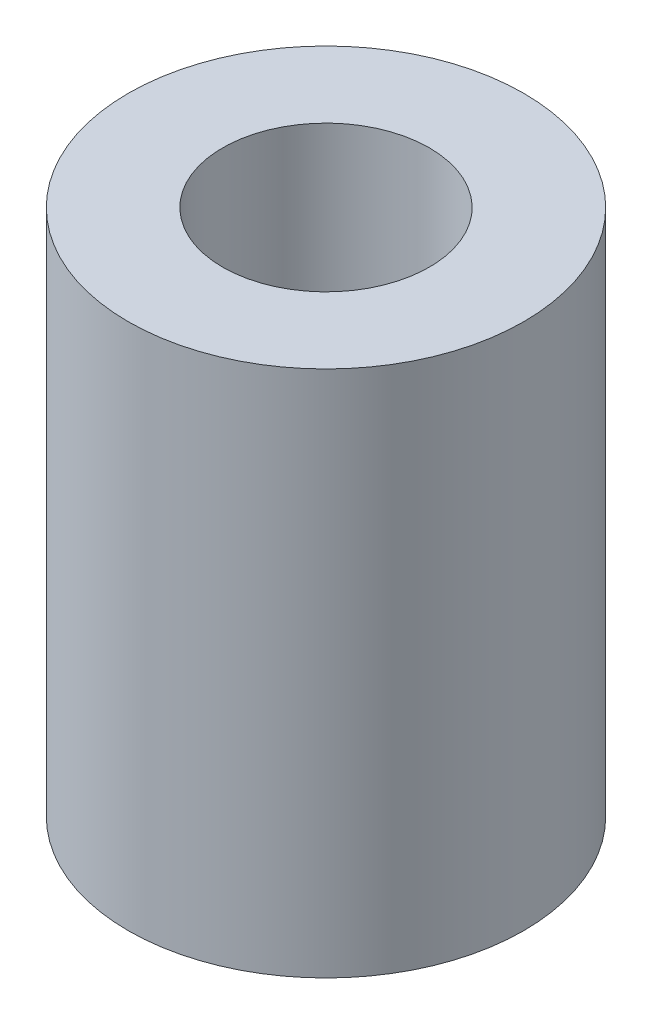
ISO-10303-21;
HEADER;
FILE_DESCRIPTION(('STEP AP214'),'2;1');
FILE_NAME('part.step','',(''),(''),'','','');
FILE_SCHEMA(('AUTOMOTIVE_DESIGN { 1 0 10303 214 1 1 1 1 }'));
ENDSEC;
DATA;
#1=APPLICATION_CONTEXT('core data for automotive mechanical design processes');
#2=APPLICATION_PROTOCOL_DEFINITION('international standard','automotive_design',2000,#1);
#3=PRODUCT_CONTEXT('',#1,'mechanical');
#4=PRODUCT('Part','Part','',(#3));
#5=PRODUCT_RELATED_PRODUCT_CATEGORY('part','',(#4));
#6=PRODUCT_DEFINITION_FORMATION('','',#4);
#7=PRODUCT_DEFINITION_CONTEXT('part definition',#1,'design');
#8=PRODUCT_DEFINITION('design','',#6,#7);
#9=PRODUCT_DEFINITION_SHAPE('','',#8);
#10=(LENGTH_UNIT() NAMED_UNIT(*) SI_UNIT(.MILLI.,.METRE.));
#11=(NAMED_UNIT(*) PLANE_ANGLE_UNIT() SI_UNIT($,.RADIAN.));
#12=(NAMED_UNIT(*) SI_UNIT($,.STERADIAN.) SOLID_ANGLE_UNIT());
#13=UNCERTAINTY_MEASURE_WITH_UNIT(LENGTH_MEASURE(1.E-05),#10,'distance_accuracy_value','');
#14=(GEOMETRIC_REPRESENTATION_CONTEXT(3) GLOBAL_UNCERTAINTY_ASSIGNED_CONTEXT((#13)) GLOBAL_UNIT_ASSIGNED_CONTEXT((#10,
#11,#12)) REPRESENTATION_CONTEXT('',''));
#15=CARTESIAN_POINT('',(0.,0.,0.));
#16=DIRECTION('',(0.,0.,1.));
#17=DIRECTION('',(1.,0.,0.));
#18=AXIS2_PLACEMENT_3D('',#15,#16,#17);
#19=CARTESIAN_POINT('',(0.,-6.35,0.));
#20=DIRECTION('',(0.,1.,0.));
#21=DIRECTION('',(0.,0.,1.));
#22=AXIS2_PLACEMENT_3D('',#19,#20,#21);
#23=CYLINDRICAL_SURFACE('',#22,4.7625);
#24=CARTESIAN_POINT('',(0.,-6.35,0.));
#25=DIRECTION('',(0.,1.,0.));
#26=DIRECTION('',(0.,0.,-1.));
#27=AXIS2_PLACEMENT_3D('',#24,#25,#26);
#28=CIRCLE('',#27,4.7625);
#29=CARTESIAN_POINT('',(0.,-6.35,-4.7625));
#30=VERTEX_POINT('',#29);
#31=EDGE_CURVE('E10',#30,#30,#28,.T.);
#32=ORIENTED_EDGE('',*,*,#31,.T.);
#33=EDGE_LOOP('',(#32));
#34=FACE_BOUND('',#33,.T.);
#35=CARTESIAN_POINT('',(0.,6.35,0.));
#36=DIRECTION('',(0.,1.,0.));
#37=DIRECTION('',(0.,0.,-1.));
#38=AXIS2_PLACEMENT_3D('',#35,#36,#37);
#39=CIRCLE('',#38,4.7625);
#40=CARTESIAN_POINT('',(0.,6.35,-4.7625));
#41=VERTEX_POINT('',#40);
#42=EDGE_CURVE('E42',#41,#41,#39,.T.);
#43=ORIENTED_EDGE('',*,*,#42,.F.);
#44=EDGE_LOOP('',(#43));
#45=FACE_BOUND('',#44,.T.);
#46=ADVANCED_FACE('F39',(#34,#45),#23,.T.);
#47=CARTESIAN_POINT('',(0.,-6.35,0.));
#48=DIRECTION('',(0.,-1.,0.));
#49=DIRECTION('',(0.,0.,-1.));
#50=AXIS2_PLACEMENT_3D('',#47,#48,#49);
#51=PLANE('',#50);
#52=CARTESIAN_POINT('',(0.,-6.35,0.));
#53=DIRECTION('',(0.,1.,0.));
#54=DIRECTION('',(0.,0.,-1.));
#55=AXIS2_PLACEMENT_3D('',#52,#53,#54);
#56=CIRCLE('',#55,2.4892);
#57=CARTESIAN_POINT('',(0.,-6.35,-2.4892));
#58=VERTEX_POINT('',#57);
#59=EDGE_CURVE('E49',#58,#58,#56,.T.);
#60=ORIENTED_EDGE('',*,*,#59,.T.);
#61=EDGE_LOOP('',(#60));
#62=FACE_BOUND('',#61,.T.);
#63=ORIENTED_EDGE('',*,*,#31,.F.);
#64=EDGE_LOOP('',(#63));
#65=FACE_BOUND('',#64,.T.);
#66=ADVANCED_FACE('F57',(#62,#65),#51,.T.);
#67=CARTESIAN_POINT('',(0.,6.35,0.));
#68=DIRECTION('',(0.,-1.,0.));
#69=DIRECTION('',(0.,0.,-1.));
#70=AXIS2_PLACEMENT_3D('',#67,#68,#69);
#71=PLANE('',#70);
#72=CARTESIAN_POINT('',(0.,6.35,0.));
#73=DIRECTION('',(0.,1.,0.));
#74=DIRECTION('',(0.,0.,-1.));
#75=AXIS2_PLACEMENT_3D('',#72,#73,#74);
#76=CIRCLE('',#75,2.4892);
#77=CARTESIAN_POINT('',(0.,6.35,-2.4892));
#78=VERTEX_POINT('',#77);
#79=EDGE_CURVE('E51',#78,#78,#76,.T.);
#80=ORIENTED_EDGE('',*,*,#79,.F.);
#81=EDGE_LOOP('',(#80));
#82=FACE_BOUND('',#81,.T.);
#83=ORIENTED_EDGE('',*,*,#42,.T.);
#84=EDGE_LOOP('',(#83));
#85=FACE_BOUND('',#84,.T.);
#86=ADVANCED_FACE('F63',(#82,#85),#71,.F.);
#87=CARTESIAN_POINT('',(0.,-6.35,0.));
#88=DIRECTION('',(0.,1.,0.));
#89=DIRECTION('',(0.,0.,1.));
#90=AXIS2_PLACEMENT_3D('',#87,#88,#89);
#91=CYLINDRICAL_SURFACE('',#90,2.4892);
#92=ORIENTED_EDGE('',*,*,#59,.F.);
#93=EDGE_LOOP('',(#92));
#94=FACE_BOUND('',#93,.T.);
#95=ORIENTED_EDGE('',*,*,#79,.T.);
#96=EDGE_LOOP('',(#95));
#97=FACE_BOUND('',#96,.T.);
#98=ADVANCED_FACE('F60',(#94,#97),#91,.F.);
#99=CLOSED_SHELL('',(#46,#66,#86,#98));
#100=MANIFOLD_SOLID_BREP('B2',#99);
#101=ADVANCED_BREP_SHAPE_REPRESENTATION('',(#18,#100),#14);
#102=SHAPE_DEFINITION_REPRESENTATION(#9,#101);
ENDSEC;
END-ISO-10303-21;
